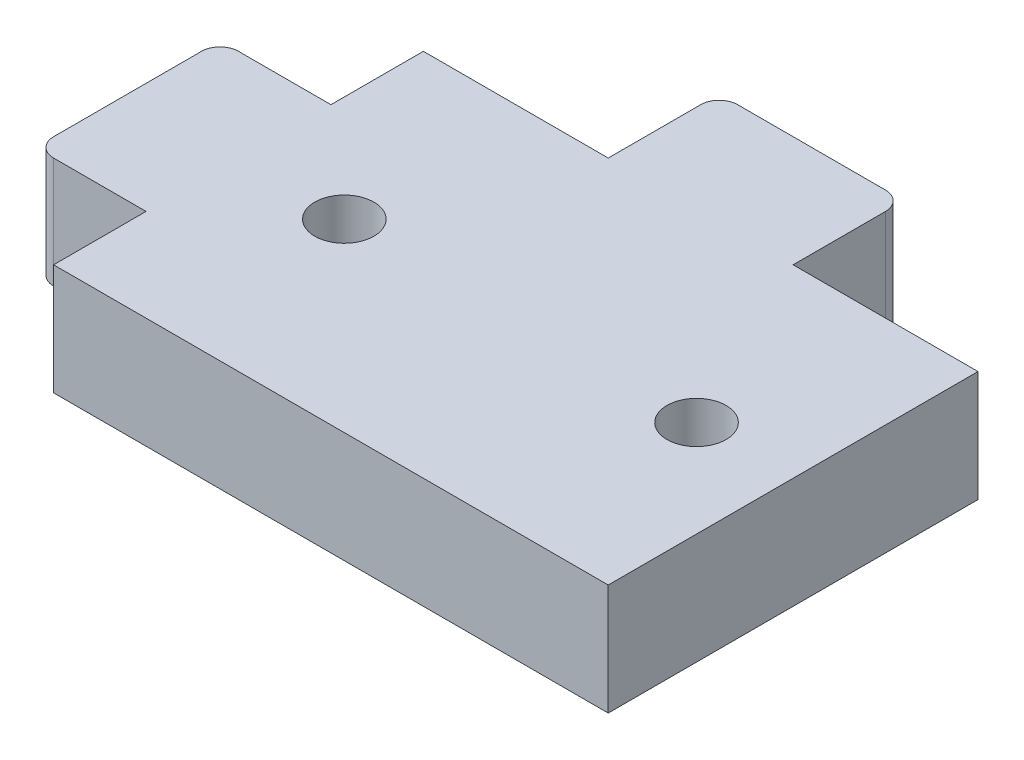
ISO-10303-21;
HEADER;
FILE_DESCRIPTION(('STEP AP214'),'2;1');
FILE_NAME('part.step','',(''),(''),'','','');
FILE_SCHEMA(('AUTOMOTIVE_DESIGN { 1 0 10303 214 1 1 1 1 }'));
ENDSEC;
DATA;
#1=APPLICATION_CONTEXT('core data for automotive mechanical design processes');
#2=APPLICATION_PROTOCOL_DEFINITION('international standard','automotive_design',2000,#1);
#3=PRODUCT_CONTEXT('',#1,'mechanical');
#4=PRODUCT('Part','Part','',(#3));
#5=PRODUCT_RELATED_PRODUCT_CATEGORY('part','',(#4));
#6=PRODUCT_DEFINITION_FORMATION('','',#4);
#7=PRODUCT_DEFINITION_CONTEXT('part definition',#1,'design');
#8=PRODUCT_DEFINITION('design','',#6,#7);
#9=PRODUCT_DEFINITION_SHAPE('','',#8);
#10=(LENGTH_UNIT() NAMED_UNIT(*) SI_UNIT(.MILLI.,.METRE.));
#11=(NAMED_UNIT(*) PLANE_ANGLE_UNIT() SI_UNIT($,.RADIAN.));
#12=(NAMED_UNIT(*) SI_UNIT($,.STERADIAN.) SOLID_ANGLE_UNIT());
#13=UNCERTAINTY_MEASURE_WITH_UNIT(LENGTH_MEASURE(1.E-05),#10,'distance_accuracy_value','');
#14=(GEOMETRIC_REPRESENTATION_CONTEXT(3) GLOBAL_UNCERTAINTY_ASSIGNED_CONTEXT((#13)) GLOBAL_UNIT_ASSIGNED_CONTEXT((#10,
#11,#12)) REPRESENTATION_CONTEXT('',''));
#15=CARTESIAN_POINT('',(0.,0.,0.));
#16=DIRECTION('',(0.,0.,1.));
#17=DIRECTION('',(1.,0.,0.));
#18=AXIS2_PLACEMENT_3D('',#15,#16,#17);
#19=CARTESIAN_POINT('',(-15.,6.,-10.));
#20=DIRECTION('',(0.,0.,1.));
#21=DIRECTION('',(1.,0.,0.));
#22=AXIS2_PLACEMENT_3D('',#19,#20,#21);
#23=PLANE('',#22);
#24=DIRECTION('',(0.,-1.,0.));
#25=VECTOR('',#24,1.);
#26=CARTESIAN_POINT('',(5.,0.,-10.));
#27=LINE('',#26,#25);
#28=CARTESIAN_POINT('',(5.,6.,-10.));
#29=VERTEX_POINT('',#28);
#30=CARTESIAN_POINT('',(5.,0.,-10.));
#31=VERTEX_POINT('',#30);
#32=EDGE_CURVE('E171',#29,#31,#27,.T.);
#33=ORIENTED_EDGE('',*,*,#32,.F.);
#34=DIRECTION('',(-1.,0.,0.));
#35=VECTOR('',#34,1.);
#36=CARTESIAN_POINT('',(-15.,6.,-10.));
#37=LINE('',#36,#35);
#38=CARTESIAN_POINT('',(15.,6.,-10.));
#39=VERTEX_POINT('',#38);
#40=EDGE_CURVE('E166',#39,#29,#37,.T.);
#41=ORIENTED_EDGE('',*,*,#40,.F.);
#42=DIRECTION('',(0.,-1.,0.));
#43=VECTOR('',#42,1.);
#44=CARTESIAN_POINT('',(15.,6.,-10.));
#45=LINE('',#44,#43);
#46=CARTESIAN_POINT('',(15.,0.,-10.));
#47=VERTEX_POINT('',#46);
#48=EDGE_CURVE('E264',#39,#47,#45,.T.);
#49=ORIENTED_EDGE('',*,*,#48,.T.);
#50=DIRECTION('',(-1.,0.,0.));
#51=VECTOR('',#50,1.);
#52=CARTESIAN_POINT('',(-15.,0.,-10.));
#53=LINE('',#52,#51);
#54=EDGE_CURVE('E241',#47,#31,#53,.T.);
#55=ORIENTED_EDGE('',*,*,#54,.T.);
#56=EDGE_LOOP('',(#33,#41,#49,#55));
#57=FACE_BOUND('',#56,.T.);
#58=ADVANCED_FACE('F35',(#57),#23,.F.);
#59=DIRECTION('',(0.,1.,0.));
#60=VECTOR('',#59,1.);
#61=CARTESIAN_POINT('',(-5.,0.,-10.));
#62=LINE('',#61,#60);
#63=CARTESIAN_POINT('',(-5.,0.,-10.));
#64=VERTEX_POINT('',#63);
#65=CARTESIAN_POINT('',(-5.,6.,-10.));
#66=VERTEX_POINT('',#65);
#67=EDGE_CURVE('E161',#64,#66,#62,.T.);
#68=ORIENTED_EDGE('',*,*,#67,.F.);
#69=CARTESIAN_POINT('',(-15.,0.,-10.));
#70=VERTEX_POINT('',#69);
#71=EDGE_CURVE('E246',#64,#70,#53,.T.);
#72=ORIENTED_EDGE('',*,*,#71,.T.);
#73=DIRECTION('',(0.,-1.,0.));
#74=VECTOR('',#73,1.);
#75=CARTESIAN_POINT('',(-15.,6.,-10.));
#76=LINE('',#75,#74);
#77=CARTESIAN_POINT('',(-15.,6.,-10.));
#78=VERTEX_POINT('',#77);
#79=EDGE_CURVE('E164',#78,#70,#76,.T.);
#80=ORIENTED_EDGE('',*,*,#79,.F.);
#81=EDGE_CURVE('E151',#66,#78,#37,.T.);
#82=ORIENTED_EDGE('',*,*,#81,.F.);
#83=EDGE_LOOP('',(#68,#72,#80,#82));
#84=FACE_BOUND('',#83,.T.);
#85=ADVANCED_FACE('F160',(#84),#23,.F.);
#86=CARTESIAN_POINT('',(-15.,6.,-10.));
#87=DIRECTION('',(1.,0.,0.));
#88=DIRECTION('',(0.,0.,-1.));
#89=AXIS2_PLACEMENT_3D('',#86,#87,#88);
#90=PLANE('',#89);
#91=DIRECTION('',(0.,-1.,0.));
#92=VECTOR('',#91,1.);
#93=CARTESIAN_POINT('',(-15.,0.,-5.));
#94=LINE('',#93,#92);
#95=CARTESIAN_POINT('',(-15.,6.,-5.));
#96=VERTEX_POINT('',#95);
#97=CARTESIAN_POINT('',(-15.,0.,-5.));
#98=VERTEX_POINT('',#97);
#99=EDGE_CURVE('E202',#96,#98,#94,.T.);
#100=ORIENTED_EDGE('',*,*,#99,.F.);
#101=DIRECTION('',(0.,0.,1.));
#102=VECTOR('',#101,1.);
#103=CARTESIAN_POINT('',(-15.,6.,-10.));
#104=LINE('',#103,#102);
#105=EDGE_CURVE('E278',#78,#96,#104,.T.);
#106=ORIENTED_EDGE('',*,*,#105,.F.);
#107=ORIENTED_EDGE('',*,*,#79,.T.);
#108=DIRECTION('',(0.,0.,1.));
#109=VECTOR('',#108,1.);
#110=CARTESIAN_POINT('',(-15.,0.,-10.));
#111=LINE('',#110,#109);
#112=EDGE_CURVE('E261',#70,#98,#111,.T.);
#113=ORIENTED_EDGE('',*,*,#112,.T.);
#114=EDGE_LOOP('',(#100,#106,#107,#113));
#115=FACE_BOUND('',#114,.T.);
#116=ADVANCED_FACE('F338',(#115),#90,.F.);
#117=DIRECTION('',(0.,1.,0.));
#118=VECTOR('',#117,1.);
#119=CARTESIAN_POINT('',(-15.,0.,5.));
#120=LINE('',#119,#118);
#121=CARTESIAN_POINT('',(-15.,0.,5.));
#122=VERTEX_POINT('',#121);
#123=CARTESIAN_POINT('',(-15.,6.,5.));
#124=VERTEX_POINT('',#123);
#125=EDGE_CURVE('E193',#122,#124,#120,.T.);
#126=ORIENTED_EDGE('',*,*,#125,.F.);
#127=CARTESIAN_POINT('',(-15.,0.,10.));
#128=VERTEX_POINT('',#127);
#129=EDGE_CURVE('E245',#122,#128,#111,.T.);
#130=ORIENTED_EDGE('',*,*,#129,.T.);
#131=DIRECTION('',(0.,-1.,0.));
#132=VECTOR('',#131,1.);
#133=CARTESIAN_POINT('',(-15.,6.,10.));
#134=LINE('',#133,#132);
#135=CARTESIAN_POINT('',(-15.,6.,10.));
#136=VERTEX_POINT('',#135);
#137=EDGE_CURVE('E268',#136,#128,#134,.T.);
#138=ORIENTED_EDGE('',*,*,#137,.F.);
#139=EDGE_CURVE('E281',#124,#136,#104,.T.);
#140=ORIENTED_EDGE('',*,*,#139,.F.);
#141=EDGE_LOOP('',(#126,#130,#138,#140));
#142=FACE_BOUND('',#141,.T.);
#143=ADVANCED_FACE('F346',(#142),#90,.F.);
#144=CARTESIAN_POINT('',(15.,6.,-10.));
#145=DIRECTION('',(-1.,0.,0.));
#146=DIRECTION('',(0.,0.,1.));
#147=AXIS2_PLACEMENT_3D('',#144,#145,#146);
#148=PLANE('',#147);
#149=DIRECTION('',(0.,0.,-1.));
#150=VECTOR('',#149,1.);
#151=CARTESIAN_POINT('',(15.,0.,-10.));
#152=LINE('',#151,#150);
#153=CARTESIAN_POINT('',(15.,0.,10.));
#154=VERTEX_POINT('',#153);
#155=EDGE_CURVE('E250',#154,#47,#152,.T.);
#156=ORIENTED_EDGE('',*,*,#155,.T.);
#157=ORIENTED_EDGE('',*,*,#48,.F.);
#158=DIRECTION('',(0.,0.,-1.));
#159=VECTOR('',#158,1.);
#160=CARTESIAN_POINT('',(15.,6.,-10.));
#161=LINE('',#160,#159);
#162=CARTESIAN_POINT('',(15.,6.,10.));
#163=VERTEX_POINT('',#162);
#164=EDGE_CURVE('E167',#163,#39,#161,.T.);
#165=ORIENTED_EDGE('',*,*,#164,.F.);
#166=DIRECTION('',(0.,-1.,0.));
#167=VECTOR('',#166,1.);
#168=CARTESIAN_POINT('',(15.,6.,10.));
#169=LINE('',#168,#167);
#170=EDGE_CURVE('E270',#163,#154,#169,.T.);
#171=ORIENTED_EDGE('',*,*,#170,.T.);
#172=EDGE_LOOP('',(#156,#157,#165,#171));
#173=FACE_BOUND('',#172,.T.);
#174=ADVANCED_FACE('F342',(#173),#148,.F.);
#175=CARTESIAN_POINT('',(-15.,6.,10.));
#176=DIRECTION('',(0.,0.,-1.));
#177=DIRECTION('',(-1.,0.,0.));
#178=AXIS2_PLACEMENT_3D('',#175,#176,#177);
#179=PLANE('',#178);
#180=DIRECTION('',(1.,0.,0.));
#181=VECTOR('',#180,1.);
#182=CARTESIAN_POINT('',(-15.,0.,10.));
#183=LINE('',#182,#181);
#184=EDGE_CURVE('E255',#128,#154,#183,.T.);
#185=ORIENTED_EDGE('',*,*,#184,.T.);
#186=ORIENTED_EDGE('',*,*,#170,.F.);
#187=DIRECTION('',(1.,0.,0.));
#188=VECTOR('',#187,1.);
#189=CARTESIAN_POINT('',(-15.,6.,10.));
#190=LINE('',#189,#188);
#191=EDGE_CURVE('E272',#136,#163,#190,.T.);
#192=ORIENTED_EDGE('',*,*,#191,.F.);
#193=ORIENTED_EDGE('',*,*,#137,.T.);
#194=EDGE_LOOP('',(#185,#186,#192,#193));
#195=FACE_BOUND('',#194,.T.);
#196=ADVANCED_FACE('F345',(#195),#179,.F.);
#197=CARTESIAN_POINT('',(0.,6.,0.));
#198=DIRECTION('',(0.,1.,0.));
#199=DIRECTION('',(0.,0.,1.));
#200=AXIS2_PLACEMENT_3D('',#197,#198,#199);
#201=PLANE('',#200);
#202=CARTESIAN_POINT('',(-9.27500000000001,6.,0.));
#203=DIRECTION('',(0.,1.,0.));
#204=DIRECTION('',(0.,0.,1.));
#205=AXIS2_PLACEMENT_3D('',#202,#203,#204);
#206=CIRCLE('',#205,1.6);
#207=CARTESIAN_POINT('',(-9.27500000000001,6.,1.6));
#208=VERTEX_POINT('',#207);
#209=EDGE_CURVE('E234',#208,#208,#206,.T.);
#210=ORIENTED_EDGE('',*,*,#209,.F.);
#211=EDGE_LOOP('',(#210));
#212=FACE_BOUND('',#211,.T.);
#213=CARTESIAN_POINT('',(9.775,6.,0.));
#214=DIRECTION('',(0.,1.,0.));
#215=DIRECTION('',(0.,0.,1.));
#216=AXIS2_PLACEMENT_3D('',#213,#214,#215);
#217=CIRCLE('',#216,1.6);
#218=CARTESIAN_POINT('',(9.775,6.,1.6));
#219=VERTEX_POINT('',#218);
#220=EDGE_CURVE('E385',#219,#219,#217,.T.);
#221=ORIENTED_EDGE('',*,*,#220,.F.);
#222=EDGE_LOOP('',(#221));
#223=FACE_BOUND('',#222,.T.);
#224=DIRECTION('',(1.,0.,0.));
#225=VECTOR('',#224,1.);
#226=CARTESIAN_POINT('',(-5.,6.,-16.));
#227=LINE('',#226,#225);
#228=CARTESIAN_POINT('',(-4.,6.,-16.));
#229=VERTEX_POINT('',#228);
#230=CARTESIAN_POINT('',(4.,6.,-16.));
#231=VERTEX_POINT('',#230);
#232=EDGE_CURVE('E174',#229,#231,#227,.T.);
#233=ORIENTED_EDGE('',*,*,#232,.F.);
#234=CARTESIAN_POINT('',(-4.,6.,-15.));
#235=DIRECTION('',(0.,1.,0.));
#236=DIRECTION('',(0.,0.,1.));
#237=AXIS2_PLACEMENT_3D('',#234,#235,#236);
#238=CIRCLE('',#237,1.);
#239=CARTESIAN_POINT('',(-5.,6.,-15.));
#240=VERTEX_POINT('',#239);
#241=EDGE_CURVE('E153',#229,#240,#238,.T.);
#242=ORIENTED_EDGE('',*,*,#241,.T.);
#243=DIRECTION('',(0.,0.,1.));
#244=VECTOR('',#243,1.);
#245=CARTESIAN_POINT('',(-5.,6.,-16.));
#246=LINE('',#245,#244);
#247=EDGE_CURVE('E146',#240,#66,#246,.T.);
#248=ORIENTED_EDGE('',*,*,#247,.T.);
#249=ORIENTED_EDGE('',*,*,#81,.T.);
#250=ORIENTED_EDGE('',*,*,#105,.T.);
#251=DIRECTION('',(1.,0.,0.));
#252=VECTOR('',#251,1.);
#253=CARTESIAN_POINT('',(-21.,6.,-5.));
#254=LINE('',#253,#252);
#255=CARTESIAN_POINT('',(-20.,6.,-5.));
#256=VERTEX_POINT('',#255);
#257=EDGE_CURVE('E196',#256,#96,#254,.T.);
#258=ORIENTED_EDGE('',*,*,#257,.F.);
#259=CARTESIAN_POINT('',(-20.,6.,-4.));
#260=DIRECTION('',(0.,1.,0.));
#261=DIRECTION('',(0.,0.,1.));
#262=AXIS2_PLACEMENT_3D('',#259,#260,#261);
#263=CIRCLE('',#262,1.);
#264=CARTESIAN_POINT('',(-21.,6.,-4.));
#265=VERTEX_POINT('',#264);
#266=EDGE_CURVE('E220',#256,#265,#263,.T.);
#267=ORIENTED_EDGE('',*,*,#266,.T.);
#268=DIRECTION('',(0.,0.,-1.));
#269=VECTOR('',#268,1.);
#270=CARTESIAN_POINT('',(-21.,6.,5.));
#271=LINE('',#270,#269);
#272=CARTESIAN_POINT('',(-21.,6.,4.));
#273=VERTEX_POINT('',#272);
#274=EDGE_CURVE('E192',#273,#265,#271,.T.);
#275=ORIENTED_EDGE('',*,*,#274,.F.);
#276=CARTESIAN_POINT('',(-20.,6.,4.));
#277=DIRECTION('',(0.,1.,0.));
#278=DIRECTION('',(0.,0.,1.));
#279=AXIS2_PLACEMENT_3D('',#276,#277,#278);
#280=CIRCLE('',#279,1.);
#281=CARTESIAN_POINT('',(-20.,6.,5.));
#282=VERTEX_POINT('',#281);
#283=EDGE_CURVE('E229',#273,#282,#280,.T.);
#284=ORIENTED_EDGE('',*,*,#283,.T.);
#285=DIRECTION('',(1.,0.,0.));
#286=VECTOR('',#285,1.);
#287=CARTESIAN_POINT('',(-21.,6.,5.));
#288=LINE('',#287,#286);
#289=EDGE_CURVE('E215',#282,#124,#288,.T.);
#290=ORIENTED_EDGE('',*,*,#289,.T.);
#291=ORIENTED_EDGE('',*,*,#139,.T.);
#292=ORIENTED_EDGE('',*,*,#191,.T.);
#293=ORIENTED_EDGE('',*,*,#164,.T.);
#294=ORIENTED_EDGE('',*,*,#40,.T.);
#295=DIRECTION('',(0.,0.,1.));
#296=VECTOR('',#295,1.);
#297=CARTESIAN_POINT('',(5.,6.,-16.));
#298=LINE('',#297,#296);
#299=CARTESIAN_POINT('',(5.,6.,-15.));
#300=VERTEX_POINT('',#299);
#301=EDGE_CURVE('E156',#300,#29,#298,.T.);
#302=ORIENTED_EDGE('',*,*,#301,.F.);
#303=CARTESIAN_POINT('',(4.,6.,-15.));
#304=DIRECTION('',(0.,1.,0.));
#305=DIRECTION('',(0.,0.,1.));
#306=AXIS2_PLACEMENT_3D('',#303,#304,#305);
#307=CIRCLE('',#306,1.);
#308=EDGE_CURVE('E311',#300,#231,#307,.T.);
#309=ORIENTED_EDGE('',*,*,#308,.T.);
#310=EDGE_LOOP('',(#233,#242,#248,#249,#250,#258,#267,#275,#284,#290,#291,#292,#293,#294,#302,#309));
#311=FACE_BOUND('',#310,.T.);
#312=ADVANCED_FACE('F149',(#212,#223,#311),#201,.T.);
#313=CARTESIAN_POINT('',(0.,0.,0.));
#314=DIRECTION('',(0.,1.,0.));
#315=DIRECTION('',(0.,0.,1.));
#316=AXIS2_PLACEMENT_3D('',#313,#314,#315);
#317=PLANE('',#316);
#318=CARTESIAN_POINT('',(-9.27500000000001,0.,0.));
#319=DIRECTION('',(0.,1.,0.));
#320=DIRECTION('',(0.,0.,1.));
#321=AXIS2_PLACEMENT_3D('',#318,#319,#320);
#322=CIRCLE('',#321,1.6);
#323=CARTESIAN_POINT('',(-9.27500000000001,0.,1.6));
#324=VERTEX_POINT('',#323);
#325=EDGE_CURVE('E388',#324,#324,#322,.T.);
#326=ORIENTED_EDGE('',*,*,#325,.T.);
#327=EDGE_LOOP('',(#326));
#328=FACE_BOUND('',#327,.T.);
#329=CARTESIAN_POINT('',(9.775,0.,0.));
#330=DIRECTION('',(0.,1.,0.));
#331=DIRECTION('',(0.,0.,1.));
#332=AXIS2_PLACEMENT_3D('',#329,#330,#331);
#333=CIRCLE('',#332,1.6);
#334=CARTESIAN_POINT('',(9.775,0.,1.6));
#335=VERTEX_POINT('',#334);
#336=EDGE_CURVE('E382',#335,#335,#333,.T.);
#337=ORIENTED_EDGE('',*,*,#336,.T.);
#338=EDGE_LOOP('',(#337));
#339=FACE_BOUND('',#338,.T.);
#340=DIRECTION('',(0.,0.,1.));
#341=VECTOR('',#340,1.);
#342=CARTESIAN_POINT('',(-5.,0.,-16.));
#343=LINE('',#342,#341);
#344=CARTESIAN_POINT('',(-5.,0.,-15.));
#345=VERTEX_POINT('',#344);
#346=EDGE_CURVE('E155',#345,#64,#343,.T.);
#347=ORIENTED_EDGE('',*,*,#346,.F.);
#348=CARTESIAN_POINT('',(-4.,0.,-15.));
#349=DIRECTION('',(0.,1.,0.));
#350=DIRECTION('',(0.,0.,1.));
#351=AXIS2_PLACEMENT_3D('',#348,#349,#350);
#352=CIRCLE('',#351,1.);
#353=CARTESIAN_POINT('',(-4.,0.,-16.));
#354=VERTEX_POINT('',#353);
#355=EDGE_CURVE('E43',#345,#354,#352,.F.);
#356=ORIENTED_EDGE('',*,*,#355,.T.);
#357=DIRECTION('',(-1.,0.,0.));
#358=VECTOR('',#357,1.);
#359=CARTESIAN_POINT('',(-5.,0.,-16.));
#360=LINE('',#359,#358);
#361=CARTESIAN_POINT('',(4.,0.,-16.));
#362=VERTEX_POINT('',#361);
#363=EDGE_CURVE('E170',#362,#354,#360,.T.);
#364=ORIENTED_EDGE('',*,*,#363,.F.);
#365=CARTESIAN_POINT('',(4.,0.,-15.));
#366=DIRECTION('',(0.,1.,0.));
#367=DIRECTION('',(0.,0.,1.));
#368=AXIS2_PLACEMENT_3D('',#365,#366,#367);
#369=CIRCLE('',#368,1.);
#370=CARTESIAN_POINT('',(5.,0.,-15.));
#371=VERTEX_POINT('',#370);
#372=EDGE_CURVE('E50',#362,#371,#369,.F.);
#373=ORIENTED_EDGE('',*,*,#372,.T.);
#374=DIRECTION('',(0.,0.,1.));
#375=VECTOR('',#374,1.);
#376=CARTESIAN_POINT('',(5.,0.,-16.));
#377=LINE('',#376,#375);
#378=EDGE_CURVE('E206',#371,#31,#377,.T.);
#379=ORIENTED_EDGE('',*,*,#378,.T.);
#380=ORIENTED_EDGE('',*,*,#54,.F.);
#381=ORIENTED_EDGE('',*,*,#155,.F.);
#382=ORIENTED_EDGE('',*,*,#184,.F.);
#383=ORIENTED_EDGE('',*,*,#129,.F.);
#384=DIRECTION('',(1.,0.,0.));
#385=VECTOR('',#384,1.);
#386=CARTESIAN_POINT('',(-21.,0.,5.));
#387=LINE('',#386,#385);
#388=CARTESIAN_POINT('',(-20.,0.,5.));
#389=VERTEX_POINT('',#388);
#390=EDGE_CURVE('E219',#389,#122,#387,.T.);
#391=ORIENTED_EDGE('',*,*,#390,.F.);
#392=CARTESIAN_POINT('',(-20.,0.,4.));
#393=DIRECTION('',(0.,1.,0.));
#394=DIRECTION('',(0.,0.,1.));
#395=AXIS2_PLACEMENT_3D('',#392,#393,#394);
#396=CIRCLE('',#395,1.);
#397=CARTESIAN_POINT('',(-21.,0.,4.));
#398=VERTEX_POINT('',#397);
#399=EDGE_CURVE('E236',#389,#398,#396,.F.);
#400=ORIENTED_EDGE('',*,*,#399,.T.);
#401=DIRECTION('',(0.,0.,1.));
#402=VECTOR('',#401,1.);
#403=CARTESIAN_POINT('',(-21.,0.,5.));
#404=LINE('',#403,#402);
#405=CARTESIAN_POINT('',(-21.,0.,-4.));
#406=VERTEX_POINT('',#405);
#407=EDGE_CURVE('E189',#406,#398,#404,.T.);
#408=ORIENTED_EDGE('',*,*,#407,.F.);
#409=CARTESIAN_POINT('',(-20.,0.,-4.));
#410=DIRECTION('',(0.,1.,0.));
#411=DIRECTION('',(0.,0.,1.));
#412=AXIS2_PLACEMENT_3D('',#409,#410,#411);
#413=CIRCLE('',#412,1.);
#414=CARTESIAN_POINT('',(-20.,0.,-5.));
#415=VERTEX_POINT('',#414);
#416=EDGE_CURVE('E232',#406,#415,#413,.F.);
#417=ORIENTED_EDGE('',*,*,#416,.T.);
#418=DIRECTION('',(1.,0.,0.));
#419=VECTOR('',#418,1.);
#420=CARTESIAN_POINT('',(-21.,0.,-5.));
#421=LINE('',#420,#419);
#422=EDGE_CURVE('E228',#415,#98,#421,.T.);
#423=ORIENTED_EDGE('',*,*,#422,.T.);
#424=ORIENTED_EDGE('',*,*,#112,.F.);
#425=ORIENTED_EDGE('',*,*,#71,.F.);
#426=EDGE_LOOP('',(#347,#356,#364,#373,#379,#380,#381,#382,#383,#391,#400,#408,#417,#423,#424,#425));
#427=FACE_BOUND('',#426,.T.);
#428=ADVANCED_FACE('F321',(#328,#339,#427),#317,.F.);
#429=CARTESIAN_POINT('',(9.775,6.,0.));
#430=DIRECTION('',(0.,1.,0.));
#431=DIRECTION('',(0.,0.,1.));
#432=AXIS2_PLACEMENT_3D('',#429,#430,#431);
#433=CYLINDRICAL_SURFACE('',#432,1.6);
#434=ORIENTED_EDGE('',*,*,#336,.F.);
#435=EDGE_LOOP('',(#434));
#436=FACE_BOUND('',#435,.T.);
#437=ORIENTED_EDGE('',*,*,#220,.T.);
#438=EDGE_LOOP('',(#437));
#439=FACE_BOUND('',#438,.T.);
#440=ADVANCED_FACE('F400',(#436,#439),#433,.F.);
#441=CARTESIAN_POINT('',(-9.27500000000001,6.,0.));
#442=DIRECTION('',(0.,1.,0.));
#443=DIRECTION('',(0.,0.,1.));
#444=AXIS2_PLACEMENT_3D('',#441,#442,#443);
#445=CYLINDRICAL_SURFACE('',#444,1.6);
#446=ORIENTED_EDGE('',*,*,#325,.F.);
#447=EDGE_LOOP('',(#446));
#448=FACE_BOUND('',#447,.T.);
#449=ORIENTED_EDGE('',*,*,#209,.T.);
#450=EDGE_LOOP('',(#449));
#451=FACE_BOUND('',#450,.T.);
#452=ADVANCED_FACE('F393',(#448,#451),#445,.F.);
#453=CARTESIAN_POINT('',(-21.,0.,-5.));
#454=DIRECTION('',(0.,0.,1.));
#455=DIRECTION('',(0.,-1.,0.));
#456=AXIS2_PLACEMENT_3D('',#453,#454,#455);
#457=PLANE('',#456);
#458=ORIENTED_EDGE('',*,*,#422,.F.);
#459=DIRECTION('',(0.,-1.,0.));
#460=VECTOR('',#459,1.);
#461=CARTESIAN_POINT('',(-20.,6.,-5.));
#462=LINE('',#461,#460);
#463=EDGE_CURVE('E238',#415,#256,#462,.F.);
#464=ORIENTED_EDGE('',*,*,#463,.T.);
#465=ORIENTED_EDGE('',*,*,#257,.T.);
#466=ORIENTED_EDGE('',*,*,#99,.T.);
#467=EDGE_LOOP('',(#458,#464,#465,#466));
#468=FACE_BOUND('',#467,.T.);
#469=ADVANCED_FACE('F408',(#468),#457,.F.);
#470=CARTESIAN_POINT('',(-21.,0.,5.));
#471=DIRECTION('',(0.,0.,-1.));
#472=DIRECTION('',(0.,1.,0.));
#473=AXIS2_PLACEMENT_3D('',#470,#471,#472);
#474=PLANE('',#473);
#475=ORIENTED_EDGE('',*,*,#289,.F.);
#476=DIRECTION('',(0.,1.,0.));
#477=VECTOR('',#476,1.);
#478=CARTESIAN_POINT('',(-20.,0.,5.));
#479=LINE('',#478,#477);
#480=EDGE_CURVE('E230',#282,#389,#479,.F.);
#481=ORIENTED_EDGE('',*,*,#480,.T.);
#482=ORIENTED_EDGE('',*,*,#390,.T.);
#483=ORIENTED_EDGE('',*,*,#125,.T.);
#484=EDGE_LOOP('',(#475,#481,#482,#483));
#485=FACE_BOUND('',#484,.T.);
#486=ADVANCED_FACE('F376',(#485),#474,.F.);
#487=CARTESIAN_POINT('',(-21.,0.,0.));
#488=DIRECTION('',(-1.,0.,0.));
#489=DIRECTION('',(0.,0.,1.));
#490=AXIS2_PLACEMENT_3D('',#487,#488,#489);
#491=PLANE('',#490);
#492=ORIENTED_EDGE('',*,*,#407,.T.);
#493=DIRECTION('',(0.,1.,0.));
#494=VECTOR('',#493,1.);
#495=CARTESIAN_POINT('',(-21.,6.,4.));
#496=LINE('',#495,#494);
#497=EDGE_CURVE('E216',#398,#273,#496,.T.);
#498=ORIENTED_EDGE('',*,*,#497,.T.);
#499=ORIENTED_EDGE('',*,*,#274,.T.);
#500=DIRECTION('',(0.,-1.,0.));
#501=VECTOR('',#500,1.);
#502=CARTESIAN_POINT('',(-21.,0.,-4.));
#503=LINE('',#502,#501);
#504=EDGE_CURVE('E211',#265,#406,#503,.T.);
#505=ORIENTED_EDGE('',*,*,#504,.T.);
#506=EDGE_LOOP('',(#492,#498,#499,#505));
#507=FACE_BOUND('',#506,.T.);
#508=ADVANCED_FACE('F350',(#507),#491,.T.);
#509=CARTESIAN_POINT('',(-20.,0.,4.));
#510=DIRECTION('',(0.,-1.,0.));
#511=DIRECTION('',(0.,0.,-1.));
#512=AXIS2_PLACEMENT_3D('',#509,#510,#511);
#513=CYLINDRICAL_SURFACE('',#512,1.);
#514=ORIENTED_EDGE('',*,*,#399,.F.);
#515=ORIENTED_EDGE('',*,*,#480,.F.);
#516=ORIENTED_EDGE('',*,*,#283,.F.);
#517=ORIENTED_EDGE('',*,*,#497,.F.);
#518=EDGE_LOOP('',(#514,#515,#516,#517));
#519=FACE_BOUND('',#518,.T.);
#520=ADVANCED_FACE('F347',(#519),#513,.T.);
#521=CARTESIAN_POINT('',(-20.,0.,-4.));
#522=DIRECTION('',(0.,1.,0.));
#523=DIRECTION('',(0.,0.,1.));
#524=AXIS2_PLACEMENT_3D('',#521,#522,#523);
#525=CYLINDRICAL_SURFACE('',#524,1.);
#526=ORIENTED_EDGE('',*,*,#266,.F.);
#527=ORIENTED_EDGE('',*,*,#463,.F.);
#528=ORIENTED_EDGE('',*,*,#416,.F.);
#529=ORIENTED_EDGE('',*,*,#504,.F.);
#530=EDGE_LOOP('',(#526,#527,#528,#529));
#531=FACE_BOUND('',#530,.T.);
#532=ADVANCED_FACE('F349',(#531),#525,.T.);
#533=CARTESIAN_POINT('',(5.,0.,-16.));
#534=DIRECTION('',(-1.,0.,0.));
#535=DIRECTION('',(0.,-1.,0.));
#536=AXIS2_PLACEMENT_3D('',#533,#534,#535);
#537=PLANE('',#536);
#538=ORIENTED_EDGE('',*,*,#378,.F.);
#539=DIRECTION('',(0.,-1.,0.));
#540=VECTOR('',#539,1.);
#541=CARTESIAN_POINT('',(5.,6.,-15.));
#542=LINE('',#541,#540);
#543=EDGE_CURVE('E11',#371,#300,#542,.F.);
#544=ORIENTED_EDGE('',*,*,#543,.T.);
#545=ORIENTED_EDGE('',*,*,#301,.T.);
#546=ORIENTED_EDGE('',*,*,#32,.T.);
#547=EDGE_LOOP('',(#538,#544,#545,#546));
#548=FACE_BOUND('',#547,.T.);
#549=ADVANCED_FACE('F296',(#548),#537,.F.);
#550=CARTESIAN_POINT('',(-5.,0.,-16.));
#551=DIRECTION('',(1.,0.,0.));
#552=DIRECTION('',(0.,1.,0.));
#553=AXIS2_PLACEMENT_3D('',#550,#551,#552);
#554=PLANE('',#553);
#555=ORIENTED_EDGE('',*,*,#247,.F.);
#556=DIRECTION('',(0.,1.,0.));
#557=VECTOR('',#556,1.);
#558=CARTESIAN_POINT('',(-5.,0.,-15.));
#559=LINE('',#558,#557);
#560=EDGE_CURVE('E58',#240,#345,#559,.F.);
#561=ORIENTED_EDGE('',*,*,#560,.T.);
#562=ORIENTED_EDGE('',*,*,#346,.T.);
#563=ORIENTED_EDGE('',*,*,#67,.T.);
#564=EDGE_LOOP('',(#555,#561,#562,#563));
#565=FACE_BOUND('',#564,.T.);
#566=ADVANCED_FACE('F169',(#565),#554,.F.);
#567=CARTESIAN_POINT('',(0.,0.,-16.));
#568=DIRECTION('',(0.,0.,-1.));
#569=DIRECTION('',(-1.,0.,0.));
#570=AXIS2_PLACEMENT_3D('',#567,#568,#569);
#571=PLANE('',#570);
#572=ORIENTED_EDGE('',*,*,#363,.T.);
#573=DIRECTION('',(0.,1.,0.));
#574=VECTOR('',#573,1.);
#575=CARTESIAN_POINT('',(-4.,6.,-16.));
#576=LINE('',#575,#574);
#577=EDGE_CURVE('E302',#354,#229,#576,.T.);
#578=ORIENTED_EDGE('',*,*,#577,.T.);
#579=ORIENTED_EDGE('',*,*,#232,.T.);
#580=DIRECTION('',(0.,-1.,0.));
#581=VECTOR('',#580,1.);
#582=CARTESIAN_POINT('',(4.,0.,-16.));
#583=LINE('',#582,#581);
#584=EDGE_CURVE('E240',#231,#362,#583,.T.);
#585=ORIENTED_EDGE('',*,*,#584,.T.);
#586=EDGE_LOOP('',(#572,#578,#579,#585));
#587=FACE_BOUND('',#586,.T.);
#588=ADVANCED_FACE('F323',(#587),#571,.T.);
#589=CARTESIAN_POINT('',(-4.,0.,-15.));
#590=DIRECTION('',(0.,-1.,0.));
#591=DIRECTION('',(1.,0.,0.));
#592=AXIS2_PLACEMENT_3D('',#589,#590,#591);
#593=CYLINDRICAL_SURFACE('',#592,1.);
#594=ORIENTED_EDGE('',*,*,#355,.F.);
#595=ORIENTED_EDGE('',*,*,#560,.F.);
#596=ORIENTED_EDGE('',*,*,#241,.F.);
#597=ORIENTED_EDGE('',*,*,#577,.F.);
#598=EDGE_LOOP('',(#594,#595,#596,#597));
#599=FACE_BOUND('',#598,.T.);
#600=ADVANCED_FACE('F324',(#599),#593,.T.);
#601=CARTESIAN_POINT('',(4.,0.,-15.));
#602=DIRECTION('',(0.,1.,0.));
#603=DIRECTION('',(-1.,0.,0.));
#604=AXIS2_PLACEMENT_3D('',#601,#602,#603);
#605=CYLINDRICAL_SURFACE('',#604,1.);
#606=ORIENTED_EDGE('',*,*,#308,.F.);
#607=ORIENTED_EDGE('',*,*,#543,.F.);
#608=ORIENTED_EDGE('',*,*,#372,.F.);
#609=ORIENTED_EDGE('',*,*,#584,.F.);
#610=EDGE_LOOP('',(#606,#607,#608,#609));
#611=FACE_BOUND('',#610,.T.);
#612=ADVANCED_FACE('F37',(#611),#605,.T.);
#613=CLOSED_SHELL('',(#58,#85,#116,#143,#174,#196,#312,#428,#440,#452,#469,#486,#508,#520,#532,
#549,#566,#588,#600,#612));
#614=MANIFOLD_SOLID_BREP('B2',#613);
#615=ADVANCED_BREP_SHAPE_REPRESENTATION('',(#18,#614),#14);
#616=SHAPE_DEFINITION_REPRESENTATION(#9,#615);
ENDSEC;
END-ISO-10303-21;
